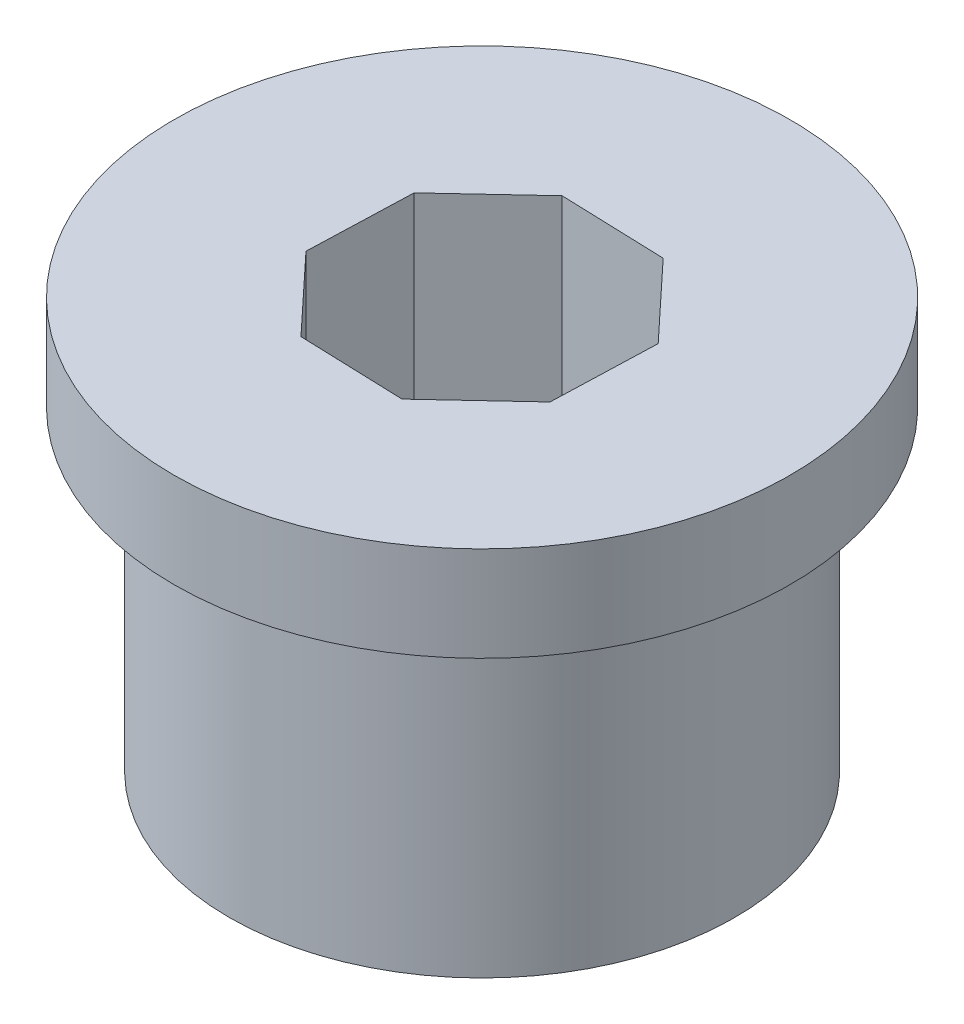
ISO-10303-21;
HEADER;
FILE_DESCRIPTION(('STEP AP214'),'2;1');
FILE_NAME('part.step','',(''),(''),'','','');
FILE_SCHEMA(('AUTOMOTIVE_DESIGN { 1 0 10303 214 1 1 1 1 }'));
ENDSEC;
DATA;
#1=APPLICATION_CONTEXT('core data for automotive mechanical design processes');
#2=APPLICATION_PROTOCOL_DEFINITION('international standard','automotive_design',2000,#1);
#3=PRODUCT_CONTEXT('',#1,'mechanical');
#4=PRODUCT('Part','Part','',(#3));
#5=PRODUCT_RELATED_PRODUCT_CATEGORY('part','',(#4));
#6=PRODUCT_DEFINITION_FORMATION('','',#4);
#7=PRODUCT_DEFINITION_CONTEXT('part definition',#1,'design');
#8=PRODUCT_DEFINITION('design','',#6,#7);
#9=PRODUCT_DEFINITION_SHAPE('','',#8);
#10=(LENGTH_UNIT() NAMED_UNIT(*) SI_UNIT(.MILLI.,.METRE.));
#11=(NAMED_UNIT(*) PLANE_ANGLE_UNIT() SI_UNIT($,.RADIAN.));
#12=(NAMED_UNIT(*) SI_UNIT($,.STERADIAN.) SOLID_ANGLE_UNIT());
#13=UNCERTAINTY_MEASURE_WITH_UNIT(LENGTH_MEASURE(1.E-05),#10,'distance_accuracy_value','');
#14=(GEOMETRIC_REPRESENTATION_CONTEXT(3) GLOBAL_UNCERTAINTY_ASSIGNED_CONTEXT((#13)) GLOBAL_UNIT_ASSIGNED_CONTEXT((#10,
#11,#12)) REPRESENTATION_CONTEXT('',''));
#15=CARTESIAN_POINT('',(0.,0.,0.));
#16=DIRECTION('',(0.,0.,1.));
#17=DIRECTION('',(1.,0.,0.));
#18=AXIS2_PLACEMENT_3D('',#15,#16,#17);
#19=CARTESIAN_POINT('',(0.,10.,0.));
#20=DIRECTION('',(0.,-1.,0.));
#21=DIRECTION('',(0.,0.,-1.));
#22=AXIS2_PLACEMENT_3D('',#19,#20,#21);
#23=CYLINDRICAL_SURFACE('',#22,8.);
#24=CARTESIAN_POINT('',(0.,10.,0.));
#25=DIRECTION('',(0.,1.,0.));
#26=DIRECTION('',(0.,0.,1.));
#27=AXIS2_PLACEMENT_3D('',#24,#25,#26);
#28=CIRCLE('',#27,8.);
#29=CARTESIAN_POINT('',(0.,10.,8.));
#30=VERTEX_POINT('',#29);
#31=EDGE_CURVE('E11',#30,#30,#28,.T.);
#32=ORIENTED_EDGE('',*,*,#31,.F.);
#33=EDGE_LOOP('',(#32));
#34=FACE_BOUND('',#33,.T.);
#35=CARTESIAN_POINT('',(0.,0.,0.));
#36=DIRECTION('',(0.,1.,0.));
#37=DIRECTION('',(0.,0.,1.));
#38=AXIS2_PLACEMENT_3D('',#35,#36,#37);
#39=CIRCLE('',#38,8.);
#40=CARTESIAN_POINT('',(0.,0.,8.));
#41=VERTEX_POINT('',#40);
#42=EDGE_CURVE('E35',#41,#41,#39,.T.);
#43=ORIENTED_EDGE('',*,*,#42,.T.);
#44=EDGE_LOOP('',(#43));
#45=FACE_BOUND('',#44,.T.);
#46=ADVANCED_FACE('F32',(#34,#45),#23,.T.);
#47=CARTESIAN_POINT('',(0.,0.,0.));
#48=DIRECTION('',(0.,1.,0.));
#49=DIRECTION('',(0.,0.,1.));
#50=AXIS2_PLACEMENT_3D('',#47,#48,#49);
#51=PLANE('',#50);
#52=DIRECTION('',(0.999427116246627,0.,0.0338443394225824));
#53=VECTOR('',#52,1.);
#54=CARTESIAN_POINT('',(-1.79128242230147,0.,3.94163332739294));
#55=LINE('',#54,#53);
#56=CARTESIAN_POINT('',(-1.79128242230147,0.,3.94163332739294));
#57=VERTEX_POINT('',#56);
#58=CARTESIAN_POINT('',(1.52052770692081,0.,4.05378360258008));
#59=VERTEX_POINT('',#58);
#60=EDGE_CURVE('E104',#57,#59,#55,.T.);
#61=ORIENTED_EDGE('',*,*,#60,.T.);
#62=DIRECTION('',(0.730633253110193,0.,-0.682770129289219));
#63=VECTOR('',#62,1.);
#64=CARTESIAN_POINT('',(1.52052770692081,0.,4.05378360258008));
#65=LINE('',#64,#63);
#66=CARTESIAN_POINT('',(3.94163332739294,0.,1.79128242230147));
#67=VERTEX_POINT('',#66);
#68=EDGE_CURVE('E98',#59,#67,#65,.T.);
#69=ORIENTED_EDGE('',*,*,#68,.T.);
#70=DIRECTION('',(0.0338443394225827,0.,-0.999427116246627));
#71=VECTOR('',#70,1.);
#72=CARTESIAN_POINT('',(3.94163332739294,0.,1.79128242230147));
#73=LINE('',#72,#71);
#74=CARTESIAN_POINT('',(4.05378360258008,0.,-1.52052770692081));
#75=VERTEX_POINT('',#74);
#76=EDGE_CURVE('E107',#67,#75,#73,.T.);
#77=ORIENTED_EDGE('',*,*,#76,.T.);
#78=DIRECTION('',(-0.682770129289219,0.,-0.730633253110193));
#79=VECTOR('',#78,1.);
#80=CARTESIAN_POINT('',(4.05378360258008,0.,-1.52052770692081));
#81=LINE('',#80,#79);
#82=CARTESIAN_POINT('',(1.79128242230146,0.,-3.94163332739294));
#83=VERTEX_POINT('',#82);
#84=EDGE_CURVE('E46',#75,#83,#81,.T.);
#85=ORIENTED_EDGE('',*,*,#84,.T.);
#86=DIRECTION('',(-0.999427116246627,0.,-0.0338443394225822));
#87=VECTOR('',#86,1.);
#88=CARTESIAN_POINT('',(1.79128242230146,0.,-3.94163332739294));
#89=LINE('',#88,#87);
#90=CARTESIAN_POINT('',(-1.52052770692081,0.,-4.05378360258008));
#91=VERTEX_POINT('',#90);
#92=EDGE_CURVE('E122',#83,#91,#89,.T.);
#93=ORIENTED_EDGE('',*,*,#92,.T.);
#94=DIRECTION('',(-0.730633253110193,0.,0.682770129289219));
#95=VECTOR('',#94,1.);
#96=CARTESIAN_POINT('',(-1.52052770692081,0.,-4.05378360258008));
#97=LINE('',#96,#95);
#98=CARTESIAN_POINT('',(-3.94163332739294,0.,-1.79128242230146));
#99=VERTEX_POINT('',#98);
#100=EDGE_CURVE('E125',#91,#99,#97,.T.);
#101=ORIENTED_EDGE('',*,*,#100,.T.);
#102=DIRECTION('',(-0.0338443394225822,0.,0.999427116246627));
#103=VECTOR('',#102,1.);
#104=CARTESIAN_POINT('',(-3.94163332739294,0.,-1.79128242230146));
#105=LINE('',#104,#103);
#106=CARTESIAN_POINT('',(-4.05378360258008,0.,1.52052770692081));
#107=VERTEX_POINT('',#106);
#108=EDGE_CURVE('E128',#99,#107,#105,.T.);
#109=ORIENTED_EDGE('',*,*,#108,.T.);
#110=DIRECTION('',(0.682770129289219,0.,0.730633253110193));
#111=VECTOR('',#110,1.);
#112=CARTESIAN_POINT('',(-4.05378360258008,0.,1.52052770692081));
#113=LINE('',#112,#111);
#114=EDGE_CURVE('E131',#107,#57,#113,.T.);
#115=ORIENTED_EDGE('',*,*,#114,.T.);
#116=EDGE_LOOP('',(#61,#69,#77,#85,#93,#101,#109,#115));
#117=FACE_BOUND('',#116,.T.);
#118=ORIENTED_EDGE('',*,*,#42,.F.);
#119=EDGE_LOOP('',(#118));
#120=FACE_BOUND('',#119,.T.);
#121=ADVANCED_FACE('F111',(#117,#120),#51,.F.);
#122=CARTESIAN_POINT('',(0.,10.,0.));
#123=DIRECTION('',(0.,1.,0.));
#124=DIRECTION('',(0.,0.,1.));
#125=AXIS2_PLACEMENT_3D('',#122,#123,#124);
#126=PLANE('',#125);
#127=CARTESIAN_POINT('',(0.,10.,0.));
#128=DIRECTION('',(0.,1.,0.));
#129=DIRECTION('',(0.,0.,1.));
#130=AXIS2_PLACEMENT_3D('',#127,#128,#129);
#131=CIRCLE('',#130,9.75);
#132=CARTESIAN_POINT('',(0.,10.,9.75));
#133=VERTEX_POINT('',#132);
#134=EDGE_CURVE('E153',#133,#133,#131,.T.);
#135=ORIENTED_EDGE('',*,*,#134,.F.);
#136=EDGE_LOOP('',(#135));
#137=FACE_BOUND('',#136,.T.);
#138=ORIENTED_EDGE('',*,*,#31,.T.);
#139=EDGE_LOOP('',(#138));
#140=FACE_BOUND('',#139,.T.);
#141=ADVANCED_FACE('F173',(#137,#140),#126,.F.);
#142=CARTESIAN_POINT('',(0.,13.,0.));
#143=DIRECTION('',(0.,-1.,0.));
#144=DIRECTION('',(0.,0.,-1.));
#145=AXIS2_PLACEMENT_3D('',#142,#143,#144);
#146=CYLINDRICAL_SURFACE('',#145,9.75);
#147=CARTESIAN_POINT('',(0.,13.,0.));
#148=DIRECTION('',(0.,1.,0.));
#149=DIRECTION('',(0.,0.,1.));
#150=AXIS2_PLACEMENT_3D('',#147,#148,#149);
#151=CIRCLE('',#150,9.75);
#152=CARTESIAN_POINT('',(0.,13.,9.75));
#153=VERTEX_POINT('',#152);
#154=EDGE_CURVE('E165',#153,#153,#151,.T.);
#155=ORIENTED_EDGE('',*,*,#154,.F.);
#156=EDGE_LOOP('',(#155));
#157=FACE_BOUND('',#156,.T.);
#158=ORIENTED_EDGE('',*,*,#134,.T.);
#159=EDGE_LOOP('',(#158));
#160=FACE_BOUND('',#159,.T.);
#161=ADVANCED_FACE('F171',(#157,#160),#146,.T.);
#162=CARTESIAN_POINT('',(0.,13.,0.));
#163=DIRECTION('',(0.,1.,0.));
#164=DIRECTION('',(0.,0.,1.));
#165=AXIS2_PLACEMENT_3D('',#162,#163,#164);
#166=PLANE('',#165);
#167=DIRECTION('',(0.730633253110193,0.,-0.682770129289219));
#168=VECTOR('',#167,1.);
#169=CARTESIAN_POINT('',(1.52052770692081,13.,4.05378360258008));
#170=LINE('',#169,#168);
#171=CARTESIAN_POINT('',(1.52052770692081,13.,4.05378360258008));
#172=VERTEX_POINT('',#171);
#173=CARTESIAN_POINT('',(3.94163332739294,13.,1.79128242230147));
#174=VERTEX_POINT('',#173);
#175=EDGE_CURVE('E54',#172,#174,#170,.T.);
#176=ORIENTED_EDGE('',*,*,#175,.F.);
#177=DIRECTION('',(0.999427116246627,0.,0.0338443394225824));
#178=VECTOR('',#177,1.);
#179=CARTESIAN_POINT('',(-1.79128242230147,13.,3.94163332739294));
#180=LINE('',#179,#178);
#181=CARTESIAN_POINT('',(-1.79128242230147,13.,3.94163332739294));
#182=VERTEX_POINT('',#181);
#183=EDGE_CURVE('E115',#182,#172,#180,.T.);
#184=ORIENTED_EDGE('',*,*,#183,.F.);
#185=DIRECTION('',(0.682770129289219,0.,0.730633253110193));
#186=VECTOR('',#185,1.);
#187=CARTESIAN_POINT('',(-4.05378360258008,13.,1.52052770692081));
#188=LINE('',#187,#186);
#189=CARTESIAN_POINT('',(-4.05378360258008,13.,1.52052770692081));
#190=VERTEX_POINT('',#189);
#191=EDGE_CURVE('E118',#190,#182,#188,.T.);
#192=ORIENTED_EDGE('',*,*,#191,.F.);
#193=DIRECTION('',(-0.0338443394225822,0.,0.999427116246627));
#194=VECTOR('',#193,1.);
#195=CARTESIAN_POINT('',(-3.94163332739294,13.,-1.79128242230146));
#196=LINE('',#195,#194);
#197=CARTESIAN_POINT('',(-3.94163332739294,13.,-1.79128242230146));
#198=VERTEX_POINT('',#197);
#199=EDGE_CURVE('E146',#198,#190,#196,.T.);
#200=ORIENTED_EDGE('',*,*,#199,.F.);
#201=DIRECTION('',(-0.730633253110193,0.,0.682770129289219));
#202=VECTOR('',#201,1.);
#203=CARTESIAN_POINT('',(-1.52052770692081,13.,-4.05378360258008));
#204=LINE('',#203,#202);
#205=CARTESIAN_POINT('',(-1.52052770692081,13.,-4.05378360258008));
#206=VERTEX_POINT('',#205);
#207=EDGE_CURVE('E143',#206,#198,#204,.T.);
#208=ORIENTED_EDGE('',*,*,#207,.F.);
#209=DIRECTION('',(-0.999427116246627,0.,-0.0338443394225822));
#210=VECTOR('',#209,1.);
#211=CARTESIAN_POINT('',(1.79128242230146,13.,-3.94163332739294));
#212=LINE('',#211,#210);
#213=CARTESIAN_POINT('',(1.79128242230146,13.,-3.94163332739294));
#214=VERTEX_POINT('',#213);
#215=EDGE_CURVE('E140',#214,#206,#212,.T.);
#216=ORIENTED_EDGE('',*,*,#215,.F.);
#217=DIRECTION('',(-0.682770129289219,0.,-0.730633253110193));
#218=VECTOR('',#217,1.);
#219=CARTESIAN_POINT('',(4.05378360258008,13.,-1.52052770692081));
#220=LINE('',#219,#218);
#221=CARTESIAN_POINT('',(4.05378360258008,13.,-1.52052770692081));
#222=VERTEX_POINT('',#221);
#223=EDGE_CURVE('E137',#222,#214,#220,.T.);
#224=ORIENTED_EDGE('',*,*,#223,.F.);
#225=DIRECTION('',(0.0338443394225827,0.,-0.999427116246627));
#226=VECTOR('',#225,1.);
#227=CARTESIAN_POINT('',(3.94163332739294,13.,1.79128242230147));
#228=LINE('',#227,#226);
#229=EDGE_CURVE('E135',#174,#222,#228,.T.);
#230=ORIENTED_EDGE('',*,*,#229,.F.);
#231=EDGE_LOOP('',(#176,#184,#192,#200,#208,#216,#224,#230));
#232=FACE_BOUND('',#231,.T.);
#233=ORIENTED_EDGE('',*,*,#154,.T.);
#234=EDGE_LOOP('',(#233));
#235=FACE_BOUND('',#234,.T.);
#236=ADVANCED_FACE('F188',(#232,#235),#166,.T.);
#237=CARTESIAN_POINT('',(1.52052770692081,0.,4.05378360258008));
#238=DIRECTION('',(0.682770129289219,0.,0.730633253110193));
#239=DIRECTION('',(0.730633253110193,0.,-0.682770129289219));
#240=AXIS2_PLACEMENT_3D('',#237,#238,#239);
#241=PLANE('',#240);
#242=ORIENTED_EDGE('',*,*,#175,.T.);
#243=DIRECTION('',(0.,1.,0.));
#244=VECTOR('',#243,1.);
#245=CARTESIAN_POINT('',(3.94163332739294,0.,1.79128242230147));
#246=LINE('',#245,#244);
#247=EDGE_CURVE('E94',#67,#174,#246,.T.);
#248=ORIENTED_EDGE('',*,*,#247,.F.);
#249=ORIENTED_EDGE('',*,*,#68,.F.);
#250=DIRECTION('',(0.,1.,0.));
#251=VECTOR('',#250,1.);
#252=CARTESIAN_POINT('',(1.52052770692081,0.,4.05378360258008));
#253=LINE('',#252,#251);
#254=EDGE_CURVE('E151',#59,#172,#253,.T.);
#255=ORIENTED_EDGE('',*,*,#254,.T.);
#256=EDGE_LOOP('',(#242,#248,#249,#255));
#257=FACE_BOUND('',#256,.T.);
#258=ADVANCED_FACE('F96',(#257),#241,.F.);
#259=CARTESIAN_POINT('',(-1.79128242230147,0.,3.94163332739294));
#260=DIRECTION('',(-0.0338443394225824,0.,0.999427116246627));
#261=DIRECTION('',(0.999427116246627,0.,0.0338443394225824));
#262=AXIS2_PLACEMENT_3D('',#259,#260,#261);
#263=PLANE('',#262);
#264=ORIENTED_EDGE('',*,*,#183,.T.);
#265=ORIENTED_EDGE('',*,*,#254,.F.);
#266=ORIENTED_EDGE('',*,*,#60,.F.);
#267=DIRECTION('',(0.,1.,0.));
#268=VECTOR('',#267,1.);
#269=CARTESIAN_POINT('',(-1.79128242230147,0.,3.94163332739294));
#270=LINE('',#269,#268);
#271=EDGE_CURVE('E154',#57,#182,#270,.T.);
#272=ORIENTED_EDGE('',*,*,#271,.T.);
#273=EDGE_LOOP('',(#264,#265,#266,#272));
#274=FACE_BOUND('',#273,.T.);
#275=ADVANCED_FACE('F196',(#274),#263,.F.);
#276=CARTESIAN_POINT('',(-4.05378360258008,0.,1.52052770692081));
#277=DIRECTION('',(-0.730633253110193,0.,0.682770129289219));
#278=DIRECTION('',(0.682770129289219,0.,0.730633253110193));
#279=AXIS2_PLACEMENT_3D('',#276,#277,#278);
#280=PLANE('',#279);
#281=ORIENTED_EDGE('',*,*,#191,.T.);
#282=ORIENTED_EDGE('',*,*,#271,.F.);
#283=ORIENTED_EDGE('',*,*,#114,.F.);
#284=DIRECTION('',(0.,1.,0.));
#285=VECTOR('',#284,1.);
#286=CARTESIAN_POINT('',(-4.05378360258008,0.,1.52052770692081));
#287=LINE('',#286,#285);
#288=EDGE_CURVE('E156',#107,#190,#287,.T.);
#289=ORIENTED_EDGE('',*,*,#288,.T.);
#290=EDGE_LOOP('',(#281,#282,#283,#289));
#291=FACE_BOUND('',#290,.T.);
#292=ADVANCED_FACE('F213',(#291),#280,.F.);
#293=CARTESIAN_POINT('',(-3.94163332739294,0.,-1.79128242230146));
#294=DIRECTION('',(-0.999427116246627,0.,-0.0338443394225822));
#295=DIRECTION('',(-0.0338443394225822,0.,0.999427116246627));
#296=AXIS2_PLACEMENT_3D('',#293,#294,#295);
#297=PLANE('',#296);
#298=ORIENTED_EDGE('',*,*,#199,.T.);
#299=ORIENTED_EDGE('',*,*,#288,.F.);
#300=ORIENTED_EDGE('',*,*,#108,.F.);
#301=DIRECTION('',(0.,1.,0.));
#302=VECTOR('',#301,1.);
#303=CARTESIAN_POINT('',(-3.94163332739294,0.,-1.79128242230146));
#304=LINE('',#303,#302);
#305=EDGE_CURVE('E158',#99,#198,#304,.T.);
#306=ORIENTED_EDGE('',*,*,#305,.T.);
#307=EDGE_LOOP('',(#298,#299,#300,#306));
#308=FACE_BOUND('',#307,.T.);
#309=ADVANCED_FACE('F209',(#308),#297,.F.);
#310=CARTESIAN_POINT('',(-1.52052770692081,0.,-4.05378360258008));
#311=DIRECTION('',(-0.682770129289219,0.,-0.730633253110193));
#312=DIRECTION('',(-0.730633253110193,0.,0.682770129289219));
#313=AXIS2_PLACEMENT_3D('',#310,#311,#312);
#314=PLANE('',#313);
#315=ORIENTED_EDGE('',*,*,#207,.T.);
#316=ORIENTED_EDGE('',*,*,#305,.F.);
#317=ORIENTED_EDGE('',*,*,#100,.F.);
#318=DIRECTION('',(0.,1.,0.));
#319=VECTOR('',#318,1.);
#320=CARTESIAN_POINT('',(-1.52052770692081,0.,-4.05378360258008));
#321=LINE('',#320,#319);
#322=EDGE_CURVE('E160',#91,#206,#321,.T.);
#323=ORIENTED_EDGE('',*,*,#322,.T.);
#324=EDGE_LOOP('',(#315,#316,#317,#323));
#325=FACE_BOUND('',#324,.T.);
#326=ADVANCED_FACE('F205',(#325),#314,.F.);
#327=CARTESIAN_POINT('',(1.79128242230146,0.,-3.94163332739294));
#328=DIRECTION('',(0.0338443394225822,0.,-0.999427116246627));
#329=DIRECTION('',(-0.999427116246627,0.,-0.0338443394225822));
#330=AXIS2_PLACEMENT_3D('',#327,#328,#329);
#331=PLANE('',#330);
#332=ORIENTED_EDGE('',*,*,#215,.T.);
#333=ORIENTED_EDGE('',*,*,#322,.F.);
#334=ORIENTED_EDGE('',*,*,#92,.F.);
#335=DIRECTION('',(0.,1.,0.));
#336=VECTOR('',#335,1.);
#337=CARTESIAN_POINT('',(1.79128242230146,0.,-3.94163332739294));
#338=LINE('',#337,#336);
#339=EDGE_CURVE('E162',#83,#214,#338,.T.);
#340=ORIENTED_EDGE('',*,*,#339,.T.);
#341=EDGE_LOOP('',(#332,#333,#334,#340));
#342=FACE_BOUND('',#341,.T.);
#343=ADVANCED_FACE('F202',(#342),#331,.F.);
#344=CARTESIAN_POINT('',(4.05378360258008,0.,-1.52052770692081));
#345=DIRECTION('',(0.730633253110193,0.,-0.682770129289219));
#346=DIRECTION('',(-0.682770129289219,0.,-0.730633253110193));
#347=AXIS2_PLACEMENT_3D('',#344,#345,#346);
#348=PLANE('',#347);
#349=ORIENTED_EDGE('',*,*,#223,.T.);
#350=ORIENTED_EDGE('',*,*,#339,.F.);
#351=ORIENTED_EDGE('',*,*,#84,.F.);
#352=DIRECTION('',(0.,1.,0.));
#353=VECTOR('',#352,1.);
#354=CARTESIAN_POINT('',(4.05378360258008,0.,-1.52052770692081));
#355=LINE('',#354,#353);
#356=EDGE_CURVE('E103',#75,#222,#355,.T.);
#357=ORIENTED_EDGE('',*,*,#356,.T.);
#358=EDGE_LOOP('',(#349,#350,#351,#357));
#359=FACE_BOUND('',#358,.T.);
#360=ADVANCED_FACE('F199',(#359),#348,.F.);
#361=CARTESIAN_POINT('',(3.94163332739294,0.,1.79128242230147));
#362=DIRECTION('',(0.999427116246627,0.,0.0338443394225827));
#363=DIRECTION('',(0.0338443394225827,0.,-0.999427116246627));
#364=AXIS2_PLACEMENT_3D('',#361,#362,#363);
#365=PLANE('',#364);
#366=ORIENTED_EDGE('',*,*,#229,.T.);
#367=ORIENTED_EDGE('',*,*,#356,.F.);
#368=ORIENTED_EDGE('',*,*,#76,.F.);
#369=ORIENTED_EDGE('',*,*,#247,.T.);
#370=EDGE_LOOP('',(#366,#367,#368,#369));
#371=FACE_BOUND('',#370,.T.);
#372=ADVANCED_FACE('F108',(#371),#365,.F.);
#373=CLOSED_SHELL('',(#46,#121,#141,#161,#236,#258,#275,#292,#309,#326,#343,#360,#372));
#374=MANIFOLD_SOLID_BREP('B2',#373);
#375=ADVANCED_BREP_SHAPE_REPRESENTATION('',(#18,#374),#14);
#376=SHAPE_DEFINITION_REPRESENTATION(#9,#375);
ENDSEC;
END-ISO-10303-21;
